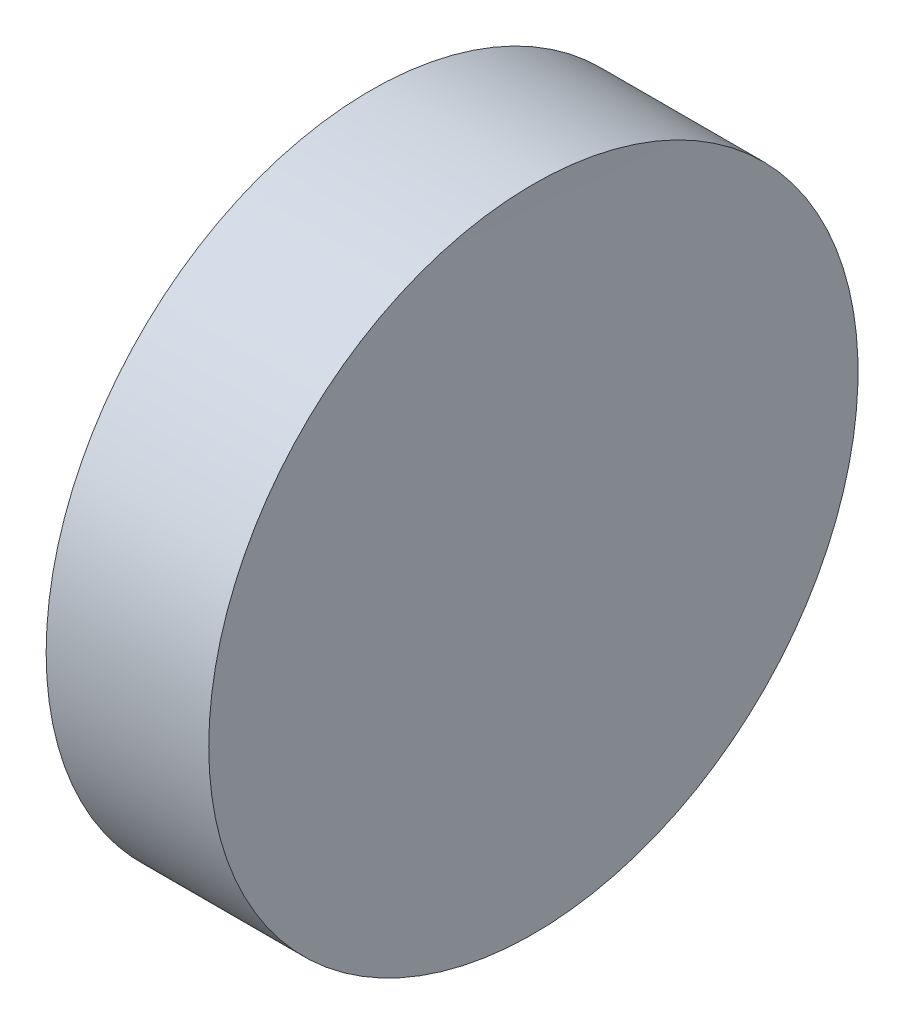
ISO-10303-21;
HEADER;
FILE_DESCRIPTION(('STEP AP214'),'2;1');
FILE_NAME('part.step','',(''),(''),'','','');
FILE_SCHEMA(('AUTOMOTIVE_DESIGN { 1 0 10303 214 1 1 1 1 }'));
ENDSEC;
DATA;
#1=APPLICATION_CONTEXT('core data for automotive mechanical design processes');
#2=APPLICATION_PROTOCOL_DEFINITION('international standard','automotive_design',2000,#1);
#3=PRODUCT_CONTEXT('',#1,'mechanical');
#4=PRODUCT('Part','Part','',(#3));
#5=PRODUCT_RELATED_PRODUCT_CATEGORY('part','',(#4));
#6=PRODUCT_DEFINITION_FORMATION('','',#4);
#7=PRODUCT_DEFINITION_CONTEXT('part definition',#1,'design');
#8=PRODUCT_DEFINITION('design','',#6,#7);
#9=PRODUCT_DEFINITION_SHAPE('','',#8);
#10=(LENGTH_UNIT() NAMED_UNIT(*) SI_UNIT(.MILLI.,.METRE.));
#11=(NAMED_UNIT(*) PLANE_ANGLE_UNIT() SI_UNIT($,.RADIAN.));
#12=(NAMED_UNIT(*) SI_UNIT($,.STERADIAN.) SOLID_ANGLE_UNIT());
#13=UNCERTAINTY_MEASURE_WITH_UNIT(LENGTH_MEASURE(1.E-05),#10,'distance_accuracy_value','');
#14=(GEOMETRIC_REPRESENTATION_CONTEXT(3) GLOBAL_UNCERTAINTY_ASSIGNED_CONTEXT((#13)) GLOBAL_UNIT_ASSIGNED_CONTEXT((#10,
#11,#12)) REPRESENTATION_CONTEXT('',''));
#15=CARTESIAN_POINT('',(0.,0.,0.));
#16=DIRECTION('',(0.,0.,1.));
#17=DIRECTION('',(1.,0.,0.));
#18=AXIS2_PLACEMENT_3D('',#15,#16,#17);
#19=CARTESIAN_POINT('',(0.,0.,0.));
#20=DIRECTION('',(1.,0.,0.));
#21=DIRECTION('',(0.,0.,-1.));
#22=AXIS2_PLACEMENT_3D('',#19,#20,#21);
#23=PLANE('',#22);
#24=CARTESIAN_POINT('',(0.,0.,0.));
#25=DIRECTION('',(-1.,0.,0.));
#26=DIRECTION('',(0.,0.,1.));
#27=AXIS2_PLACEMENT_3D('',#24,#25,#26);
#28=CIRCLE('',#27,6.35);
#29=CARTESIAN_POINT('',(0.,0.,6.35));
#30=VERTEX_POINT('',#29);
#31=EDGE_CURVE('E39',#30,#30,#28,.T.);
#32=ORIENTED_EDGE('',*,*,#31,.T.);
#33=EDGE_LOOP('',(#32));
#34=FACE_BOUND('',#33,.T.);
#35=ADVANCED_FACE('F33',(#34),#23,.F.);
#36=CARTESIAN_POINT('',(503.14,0.,0.));
#37=DIRECTION('',(-1.,0.,0.));
#38=DIRECTION('',(0.,0.,1.));
#39=AXIS2_PLACEMENT_3D('',#36,#37,#38);
#40=SPHERICAL_SURFACE('',#39,500.);
#41=CARTESIAN_POINT('',(3.18032412603519,0.,0.));
#42=DIRECTION('',(-1.,0.,0.));
#43=DIRECTION('',(0.,0.,1.));
#44=AXIS2_PLACEMENT_3D('',#41,#42,#43);
#45=CIRCLE('',#44,6.35000000000028);
#46=CARTESIAN_POINT('',(3.18032412603519,0.,6.35000000000028));
#47=VERTEX_POINT('',#46);
#48=EDGE_CURVE('E10',#47,#47,#45,.T.);
#49=ORIENTED_EDGE('',*,*,#48,.F.);
#50=EDGE_LOOP('',(#49));
#51=FACE_BOUND('',#50,.T.);
#52=ADVANCED_FACE('F48',(#51),#40,.F.);
#53=CARTESIAN_POINT('',(0.,0.,0.));
#54=DIRECTION('',(-1.,0.,0.));
#55=DIRECTION('',(0.,0.,1.));
#56=AXIS2_PLACEMENT_3D('',#53,#54,#55);
#57=CYLINDRICAL_SURFACE('',#56,6.35000000000014);
#58=ORIENTED_EDGE('',*,*,#31,.F.);
#59=EDGE_LOOP('',(#58));
#60=FACE_BOUND('',#59,.T.);
#61=ORIENTED_EDGE('',*,*,#48,.T.);
#62=EDGE_LOOP('',(#61));
#63=FACE_BOUND('',#62,.T.);
#64=ADVANCED_FACE('F46',(#60,#63),#57,.T.);
#65=CLOSED_SHELL('',(#35,#52,#64));
#66=MANIFOLD_SOLID_BREP('B2',#65);
#67=ADVANCED_BREP_SHAPE_REPRESENTATION('',(#18,#66),#14);
#68=SHAPE_DEFINITION_REPRESENTATION(#9,#67);
ENDSEC;
END-ISO-10303-21;
